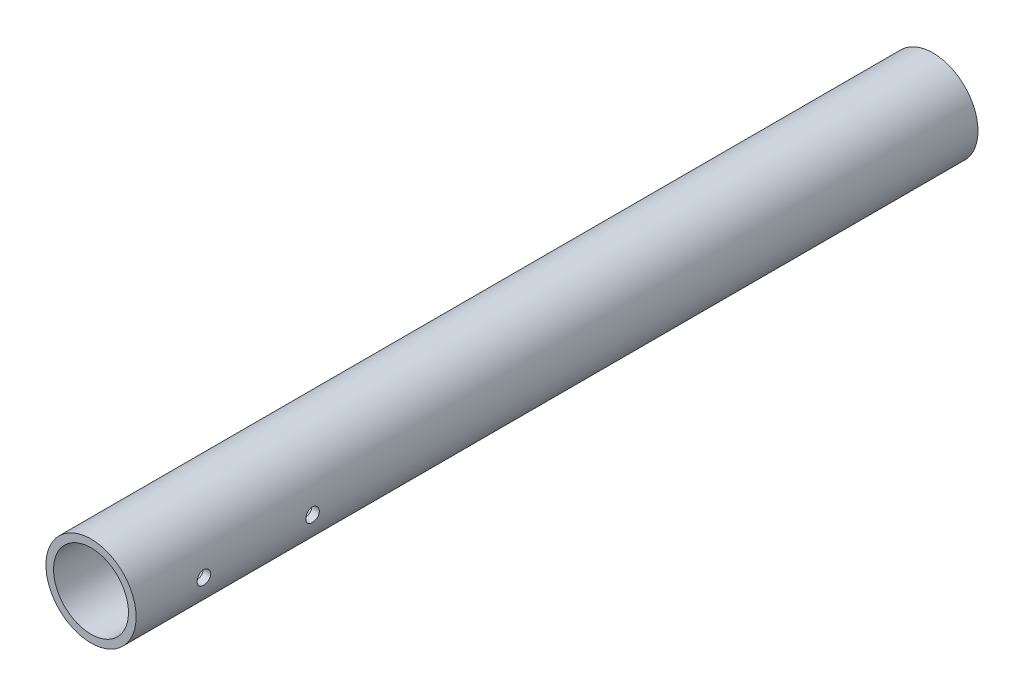
ISO-10303-21;
HEADER;
FILE_DESCRIPTION(('STEP AP214'),'2;1');
FILE_NAME('part.step','',(''),(''),'','','');
FILE_SCHEMA(('AUTOMOTIVE_DESIGN { 1 0 10303 214 1 1 1 1 }'));
ENDSEC;
DATA;
#1=APPLICATION_CONTEXT('core data for automotive mechanical design processes');
#2=APPLICATION_PROTOCOL_DEFINITION('international standard','automotive_design',2000,#1);
#3=PRODUCT_CONTEXT('',#1,'mechanical');
#4=PRODUCT('Part','Part','',(#3));
#5=PRODUCT_RELATED_PRODUCT_CATEGORY('part','',(#4));
#6=PRODUCT_DEFINITION_FORMATION('','',#4);
#7=PRODUCT_DEFINITION_CONTEXT('part definition',#1,'design');
#8=PRODUCT_DEFINITION('design','',#6,#7);
#9=PRODUCT_DEFINITION_SHAPE('','',#8);
#10=(LENGTH_UNIT() NAMED_UNIT(*) SI_UNIT(.MILLI.,.METRE.));
#11=(NAMED_UNIT(*) PLANE_ANGLE_UNIT() SI_UNIT($,.RADIAN.));
#12=(NAMED_UNIT(*) SI_UNIT($,.STERADIAN.) SOLID_ANGLE_UNIT());
#13=UNCERTAINTY_MEASURE_WITH_UNIT(LENGTH_MEASURE(1.E-05),#10,'distance_accuracy_value','');
#14=(GEOMETRIC_REPRESENTATION_CONTEXT(3) GLOBAL_UNCERTAINTY_ASSIGNED_CONTEXT((#13)) GLOBAL_UNIT_ASSIGNED_CONTEXT((#10,
#11,#12)) REPRESENTATION_CONTEXT('',''));
#15=CARTESIAN_POINT('',(0.,0.,0.));
#16=DIRECTION('',(0.,0.,1.));
#17=DIRECTION('',(1.,0.,0.));
#18=AXIS2_PLACEMENT_3D('',#15,#16,#17);
#19=CARTESIAN_POINT('',(0.,0.,0.));
#20=DIRECTION('',(0.,0.,1.));
#21=DIRECTION('',(1.,0.,0.));
#22=AXIS2_PLACEMENT_3D('',#19,#20,#21);
#23=CYLINDRICAL_SURFACE('',#22,17.526);
#24=CARTESIAN_POINT('',(0.,0.,393.7));
#25=DIRECTION('',(0.,0.,1.));
#26=DIRECTION('',(1.,0.,0.));
#27=AXIS2_PLACEMENT_3D('',#24,#25,#26);
#28=CIRCLE('',#27,17.526);
#29=CARTESIAN_POINT('',(17.526,0.,393.7));
#30=VERTEX_POINT('',#29);
#31=EDGE_CURVE('E19',#30,#30,#28,.F.);
#32=ORIENTED_EDGE('',*,*,#31,.F.);
#33=EDGE_LOOP('',(#32));
#34=FACE_BOUND('',#33,.T.);
#35=CARTESIAN_POINT('',(0.,0.,0.));
#36=DIRECTION('',(0.,0.,1.));
#37=DIRECTION('',(1.,0.,0.));
#38=AXIS2_PLACEMENT_3D('',#35,#36,#37);
#39=CIRCLE('',#38,17.526);
#40=CARTESIAN_POINT('',(17.526,0.,0.));
#41=VERTEX_POINT('',#40);
#42=EDGE_CURVE('E79',#41,#41,#39,.F.);
#43=ORIENTED_EDGE('',*,*,#42,.T.);
#44=EDGE_LOOP('',(#43));
#45=FACE_BOUND('',#44,.T.);
#46=CARTESIAN_POINT('',(17.526,0.,314.325));
#47=CARTESIAN_POINT('',(17.5259963175726,-0.176613181051217,314.324991723302));
#48=CARTESIAN_POINT('',(17.5233002826582,-0.353449171258817,314.310200668148));
#49=CARTESIAN_POINT('',(17.5127973362593,-0.702281908474051,314.251423100833));
#50=CARTESIAN_POINT('',(17.5049801575711,-0.874268208471723,314.207377935658));
#51=CARTESIAN_POINT('',(17.48511038614,-1.20810250721723,314.09147464681));
#52=CARTESIAN_POINT('',(17.473063368271,-1.36996352173552,314.019653119444));
#53=CARTESIAN_POINT('',(17.4460554580361,-1.67927316437237,313.850324943954));
#54=CARTESIAN_POINT('',(17.4310956012814,-1.82672688686375,313.752827420172));
#55=CARTESIAN_POINT('',(17.3997238299546,-2.10477719057218,313.533732397024));
#56=CARTESIAN_POINT('',(17.3832987194985,-2.23518750324315,313.411900352404));
#57=CARTESIAN_POINT('',(17.3509459564745,-2.4738411468331,313.14809368207));
#58=CARTESIAN_POINT('',(17.335018364459,-2.58208178835293,313.006116616098));
#59=CARTESIAN_POINT('',(17.3053385875312,-2.77407123838613,312.704766903283));
#60=CARTESIAN_POINT('',(17.2916032051447,-2.85763469507356,312.545274368621));
#61=CARTESIAN_POINT('',(17.2680458993697,-2.99671051245855,312.214226026226));
#62=CARTESIAN_POINT('',(17.2582236283197,-3.05222536525872,312.042671291755));
#63=CARTESIAN_POINT('',(17.2437354897132,-3.13304106760211,311.694333560972));
#64=CARTESIAN_POINT('',(17.2390149777777,-3.15866234519934,311.517627222411));
#65=CARTESIAN_POINT('',(17.2350999262051,-3.17995782709565,311.162365293601));
#66=CARTESIAN_POINT('',(17.2359049331653,-3.17563448853508,310.983809856282));
#67=CARTESIAN_POINT('',(17.2429001543548,-3.13742373793371,310.632230746528));
#68=CARTESIAN_POINT('',(17.2490242048828,-3.10389954139066,310.459166088615));
#69=CARTESIAN_POINT('',(17.2658637551246,-3.00880960849846,310.121157532169));
#70=CARTESIAN_POINT('',(17.276579474651,-2.94724252966902,309.956214022834));
#71=CARTESIAN_POINT('',(17.3014652665683,-2.79745291276667,309.638055892979));
#72=CARTESIAN_POINT('',(17.3156545368537,-2.70908155858381,309.484912899375));
#73=CARTESIAN_POINT('',(17.3458743890737,-2.50830442996264,309.195503775616));
#74=CARTESIAN_POINT('',(17.3619050065012,-2.39589819220297,309.059237970883));
#75=CARTESIAN_POINT('',(17.3942883351767,-2.14829928114741,308.805361728415));
#76=CARTESIAN_POINT('',(17.4106423451863,-2.01279967929529,308.688050627084));
#77=CARTESIAN_POINT('',(17.4416233292778,-1.72381393754225,308.477729015706));
#78=CARTESIAN_POINT('',(17.4562495353167,-1.57031985869497,308.38472929043));
#79=CARTESIAN_POINT('',(17.4821550853627,-1.24935860544027,308.22563859958));
#80=CARTESIAN_POINT('',(17.4934280108005,-1.08186540977745,308.159599150311));
#81=CARTESIAN_POINT('',(17.5112904348231,-0.738132155126105,308.056807400917));
#82=CARTESIAN_POINT('',(17.5178897862262,-0.561911340494518,308.019993467668));
#83=CARTESIAN_POINT('',(17.5231896350432,-0.320322833927916,307.990545032544));
#84=CARTESIAN_POINT('',(17.5242412276541,-0.256410066392405,307.984720466382));
#85=CARTESIAN_POINT('',(17.5256470796399,-0.128341342038203,307.976946444097));
#86=CARTESIAN_POINT('',(17.5260013382808,-0.064185384963603,307.974996992053));
#87=CARTESIAN_POINT('',(17.5259963175725,0.176613181051215,307.975008276698));
#88=CARTESIAN_POINT('',(17.5233002826582,0.353449171258822,307.989799331852));
#89=CARTESIAN_POINT('',(17.5127973362593,0.702281908474058,308.048576899167));
#90=CARTESIAN_POINT('',(17.5049801575711,0.874268208471724,308.092622064342));
#91=CARTESIAN_POINT('',(17.48511038614,1.20810250721723,308.20852535319));
#92=CARTESIAN_POINT('',(17.473063368271,1.36996352173552,308.280346880556));
#93=CARTESIAN_POINT('',(17.4460554580361,1.67927316437237,308.449675056046));
#94=CARTESIAN_POINT('',(17.4310956012814,1.82672688686375,308.547172579828));
#95=CARTESIAN_POINT('',(17.3997238299546,2.10477719057218,308.766267602976));
#96=CARTESIAN_POINT('',(17.3832987194985,2.23518750324315,308.888099647596));
#97=CARTESIAN_POINT('',(17.3509459564745,2.4738411468331,309.15190631793));
#98=CARTESIAN_POINT('',(17.335018364459,2.58208178835293,309.293883383902));
#99=CARTESIAN_POINT('',(17.3053385875312,2.77407123838613,309.595233096717));
#100=CARTESIAN_POINT('',(17.2916032051447,2.85763469507356,309.754725631379));
#101=CARTESIAN_POINT('',(17.2680458993697,2.99671051245855,310.085773973774));
#102=CARTESIAN_POINT('',(17.2582236283197,3.05222536525872,310.257328708245));
#103=CARTESIAN_POINT('',(17.2437354897132,3.13304106760211,310.605666439028));
#104=CARTESIAN_POINT('',(17.2390149777777,3.15866234519934,310.782372777589));
#105=CARTESIAN_POINT('',(17.2350999262051,3.17995782709565,311.137634706399));
#106=CARTESIAN_POINT('',(17.2359049331653,3.17563448853508,311.316190143718));
#107=CARTESIAN_POINT('',(17.2429001543548,3.13742373793371,311.667769253472));
#108=CARTESIAN_POINT('',(17.2490242048828,3.10389954139064,311.840833911385));
#109=CARTESIAN_POINT('',(17.2658637551246,3.00880960849844,312.178842467831));
#110=CARTESIAN_POINT('',(17.276579474651,2.947242529669,312.343785977166));
#111=CARTESIAN_POINT('',(17.3014652665683,2.79745291276668,312.661944107021));
#112=CARTESIAN_POINT('',(17.3156545368537,2.70908155858381,312.815087100625));
#113=CARTESIAN_POINT('',(17.3458743890737,2.50830442996264,313.104496224384));
#114=CARTESIAN_POINT('',(17.3619050065012,2.39589819220297,313.240762029117));
#115=CARTESIAN_POINT('',(17.3942883351767,2.14829928114741,313.494638271585));
#116=CARTESIAN_POINT('',(17.4106423451863,2.01279967929529,313.611949372916));
#117=CARTESIAN_POINT('',(17.4416233292778,1.72381393754225,313.822270984294));
#118=CARTESIAN_POINT('',(17.4562495353167,1.57031985869498,313.91527070957));
#119=CARTESIAN_POINT('',(17.4821550853627,1.24935860544028,314.07436140042));
#120=CARTESIAN_POINT('',(17.4934280108005,1.08186540977744,314.140400849689));
#121=CARTESIAN_POINT('',(17.5112904348231,0.738132155126103,314.243192599083));
#122=CARTESIAN_POINT('',(17.5178897862262,0.561911340494523,314.280006532332));
#123=CARTESIAN_POINT('',(17.5231896350432,0.320322833927918,314.309454967456));
#124=CARTESIAN_POINT('',(17.5242412276541,0.256410066392406,314.315279533618));
#125=CARTESIAN_POINT('',(17.5256470796399,0.1283413420382,314.323053555903));
#126=CARTESIAN_POINT('',(17.5260013382808,0.0641853849635972,314.325003007947));
#127=CARTESIAN_POINT('',(17.526,0.,314.325));
#128=B_SPLINE_CURVE_WITH_KNOTS('',3,(#46,#47,#48,#49,#50,#51,#52,#53,#54,#55,#56,#57,#58,#59,
#60,#61,#62,#63,#64,#65,#66,#67,#68,#69,#70,#71,#72,#73,#74,#75,#76,#77,#78,#79,#80,#81,#82,#83,
#84,#85,#86,#87,#88,#89,#90,#91,#92,#93,#94,#95,#96,#97,#98,#99,#100,#101,#102,#103,#104,#105,
#106,#107,#108,#109,#110,#111,#112,#113,#114,#115,#116,#117,#118,#119,#120,#121,#122,#123,#124,
#125,#126,#127),.UNSPECIFIED.,.T.,.F.,(4,2,2,2,2,2,2,2,2,2,2,2,2,2,2,2,2,2,2,2,2,2,2,2,2,2,2,2,
2,2,2,2,2,2,2,2,2,2,2,2,4),(0.,0.529594384353553,1.06025379692027,1.59021641642847,
2.11999095947089,2.6551421139281,3.19035814908337,3.72949754433927,4.26858902893715,
4.80184732449042,5.33506186343168,5.86173721299796,6.3884377784318,6.91811781642991,
7.44780806601106,7.98518312810164,8.52279617220148,9.06143174460417,9.59892835876537,
9.79139521459187,9.98386227300715,10.5134566573607,11.0441160699274,11.5740786894356,
12.103853232478,12.6390043869353,13.1742204220905,13.7133598173464,14.2524513019443,
14.7857095974976,15.3189241364388,15.8455994860052,16.372300051439,16.9019800894371,
17.4316703390182,17.9690454011088,18.5066584452086,19.0452940176113,19.5827906317725,
19.775257487599,19.9677245460143),.UNSPECIFIED.);
#129=CARTESIAN_POINT('',(17.526,0.,314.325));
#130=VERTEX_POINT('',#129);
#131=EDGE_CURVE('E73',#130,#130,#128,.T.);
#132=ORIENTED_EDGE('',*,*,#131,.T.);
#133=EDGE_LOOP('',(#132));
#134=FACE_BOUND('',#133,.T.);
#135=CARTESIAN_POINT('',(17.526,0.,365.125));
#136=CARTESIAN_POINT('',(17.5259963175726,-0.17661318105122,365.124991723302));
#137=CARTESIAN_POINT('',(17.5233002826582,-0.353449171258823,365.110200668148));
#138=CARTESIAN_POINT('',(17.5127973362593,-0.702281908474057,365.051423100833));
#139=CARTESIAN_POINT('',(17.5049801575711,-0.874268208471725,365.007377935658));
#140=CARTESIAN_POINT('',(17.48511038614,-1.20810250721724,364.89147464681));
#141=CARTESIAN_POINT('',(17.473063368271,-1.36996352173554,364.819653119444));
#142=CARTESIAN_POINT('',(17.4460554580361,-1.67927316437239,364.650324943954));
#143=CARTESIAN_POINT('',(17.4310956012814,-1.82672688686375,364.552827420172));
#144=CARTESIAN_POINT('',(17.3997238299546,-2.10477719057217,364.333732397024));
#145=CARTESIAN_POINT('',(17.3832987194985,-2.23518750324313,364.211900352404));
#146=CARTESIAN_POINT('',(17.3509459564745,-2.47384114683309,363.94809368207));
#147=CARTESIAN_POINT('',(17.335018364459,-2.58208178835292,363.806116616098));
#148=CARTESIAN_POINT('',(17.3053385875312,-2.77407123838613,363.504766903283));
#149=CARTESIAN_POINT('',(17.2916032051447,-2.85763469507356,363.345274368621));
#150=CARTESIAN_POINT('',(17.2680458993697,-2.99671051245856,363.014226026226));
#151=CARTESIAN_POINT('',(17.2582236283197,-3.05222536525872,362.842671291755));
#152=CARTESIAN_POINT('',(17.2437354897132,-3.13304106760211,362.494333560972));
#153=CARTESIAN_POINT('',(17.2390149777777,-3.15866234519934,362.317627222411));
#154=CARTESIAN_POINT('',(17.2350999262051,-3.17995782709565,361.962365293601));
#155=CARTESIAN_POINT('',(17.2359049331653,-3.17563448853508,361.783809856282));
#156=CARTESIAN_POINT('',(17.2429001543548,-3.13742373793372,361.432230746528));
#157=CARTESIAN_POINT('',(17.2490242048828,-3.10389954139067,361.259166088615));
#158=CARTESIAN_POINT('',(17.2658637551246,-3.00880960849848,360.921157532169));
#159=CARTESIAN_POINT('',(17.276579474651,-2.94724252966902,360.756214022834));
#160=CARTESIAN_POINT('',(17.3014652665683,-2.79745291276667,360.438055892979));
#161=CARTESIAN_POINT('',(17.3156545368537,-2.70908155858381,360.284912899375));
#162=CARTESIAN_POINT('',(17.3458743890737,-2.50830442996264,359.995503775616));
#163=CARTESIAN_POINT('',(17.3619050065012,-2.39589819220297,359.859237970883));
#164=CARTESIAN_POINT('',(17.3942883351767,-2.14829928114741,359.605361728415));
#165=CARTESIAN_POINT('',(17.4106423451863,-2.01279967929529,359.488050627084));
#166=CARTESIAN_POINT('',(17.4416233292778,-1.72381393754225,359.277729015706));
#167=CARTESIAN_POINT('',(17.4562495353167,-1.57031985869497,359.18472929043));
#168=CARTESIAN_POINT('',(17.4821550853627,-1.24935860544027,359.02563859958));
#169=CARTESIAN_POINT('',(17.4934280108005,-1.08186540977744,358.959599150311));
#170=CARTESIAN_POINT('',(17.5112904348231,-0.738132155126094,358.856807400917));
#171=CARTESIAN_POINT('',(17.5178897862262,-0.561911340494513,358.819993467668));
#172=CARTESIAN_POINT('',(17.5231896350432,-0.320322833927916,358.790545032544));
#173=CARTESIAN_POINT('',(17.5242412276541,-0.256410066392405,358.784720466382));
#174=CARTESIAN_POINT('',(17.5256470796399,-0.128341342038203,358.776946444097));
#175=CARTESIAN_POINT('',(17.5260013382808,-0.0641853849636031,358.774996992053));
#176=CARTESIAN_POINT('',(17.5259963175725,0.176613181051212,358.775008276698));
#177=CARTESIAN_POINT('',(17.5233002826582,0.353449171258816,358.789799331852));
#178=CARTESIAN_POINT('',(17.5127973362593,0.702281908474051,358.848576899167));
#179=CARTESIAN_POINT('',(17.5049801575711,0.87426820847172,358.892622064342));
#180=CARTESIAN_POINT('',(17.48511038614,1.20810250721724,359.00852535319));
#181=CARTESIAN_POINT('',(17.473063368271,1.36996352173554,359.080346880556));
#182=CARTESIAN_POINT('',(17.4460554580361,1.67927316437239,359.249675056046));
#183=CARTESIAN_POINT('',(17.4310956012814,1.82672688686375,359.347172579828));
#184=CARTESIAN_POINT('',(17.3997238299546,2.10477719057219,359.566267602976));
#185=CARTESIAN_POINT('',(17.3832987194985,2.23518750324317,359.688099647596));
#186=CARTESIAN_POINT('',(17.3509459564745,2.47384114683312,359.95190631793));
#187=CARTESIAN_POINT('',(17.335018364459,2.58208178835294,360.093883383902));
#188=CARTESIAN_POINT('',(17.3053385875312,2.77407123838613,360.395233096718));
#189=CARTESIAN_POINT('',(17.2916032051447,2.85763469507356,360.554725631379));
#190=CARTESIAN_POINT('',(17.2680458993697,2.99671051245856,360.885773973774));
#191=CARTESIAN_POINT('',(17.2582236283197,3.05222536525873,361.057328708245));
#192=CARTESIAN_POINT('',(17.2437354897132,3.13304106760211,361.405666439028));
#193=CARTESIAN_POINT('',(17.2390149777777,3.15866234519934,361.582372777589));
#194=CARTESIAN_POINT('',(17.2350999262051,3.17995782709565,361.937634706399));
#195=CARTESIAN_POINT('',(17.2359049331653,3.17563448853508,362.116190143718));
#196=CARTESIAN_POINT('',(17.2429001543548,3.13742373793371,362.467769253472));
#197=CARTESIAN_POINT('',(17.2490242048829,3.10389954139064,362.640833911385));
#198=CARTESIAN_POINT('',(17.2658637551246,3.00880960849843,362.978842467831));
#199=CARTESIAN_POINT('',(17.276579474651,2.947242529669,363.143785977166));
#200=CARTESIAN_POINT('',(17.3014652665683,2.79745291276667,363.461944107021));
#201=CARTESIAN_POINT('',(17.3156545368537,2.70908155858378,363.615087100625));
#202=CARTESIAN_POINT('',(17.3458743890737,2.50830442996261,363.904496224384));
#203=CARTESIAN_POINT('',(17.3619050065012,2.39589819220297,364.040762029117));
#204=CARTESIAN_POINT('',(17.3942883351767,2.14829928114742,364.294638271585));
#205=CARTESIAN_POINT('',(17.4106423451863,2.0127996792953,364.411949372916));
#206=CARTESIAN_POINT('',(17.4416233292778,1.72381393754226,364.622270984294));
#207=CARTESIAN_POINT('',(17.4562495353167,1.57031985869499,364.71527070957));
#208=CARTESIAN_POINT('',(17.4821550853627,1.24935860544028,364.87436140042));
#209=CARTESIAN_POINT('',(17.4934280108005,1.08186540977744,364.940400849689));
#210=CARTESIAN_POINT('',(17.5112904348231,0.738132155126102,365.043192599083));
#211=CARTESIAN_POINT('',(17.5178897862262,0.561911340494522,365.080006532332));
#212=CARTESIAN_POINT('',(17.5231896350432,0.320322833927917,365.109454967456));
#213=CARTESIAN_POINT('',(17.5242412276541,0.256410066392404,365.115279533618));
#214=CARTESIAN_POINT('',(17.5256470796399,0.128341342038197,365.123053555903));
#215=CARTESIAN_POINT('',(17.5260013382808,0.0641853849635962,365.125003007947));
#216=CARTESIAN_POINT('',(17.526,0.,365.125));
#217=B_SPLINE_CURVE_WITH_KNOTS('',3,(#135,#136,#137,#138,#139,#140,#141,#142,#143,#144,#145,
#146,#147,#148,#149,#150,#151,#152,#153,#154,#155,#156,#157,#158,#159,#160,#161,#162,#163,#164,
#165,#166,#167,#168,#169,#170,#171,#172,#173,#174,#175,#176,#177,#178,#179,#180,#181,#182,#183,
#184,#185,#186,#187,#188,#189,#190,#191,#192,#193,#194,#195,#196,#197,#198,#199,#200,#201,#202,
#203,#204,#205,#206,#207,#208,#209,#210,#211,#212,#213,#214,#215,#216),.UNSPECIFIED.,.T.,.F.,(4,
2,2,2,2,2,2,2,2,2,2,2,2,2,2,2,2,2,2,2,2,2,2,2,2,2,2,2,2,2,2,2,2,2,2,2,2,2,2,2,4),(0.,
0.529594384353562,1.06025379692027,1.59021641642849,2.11999095947089,2.65514211392804,
3.19035814908338,3.72949754433928,4.26858902893715,4.80184732449042,5.33506186343169,
5.86173721299791,6.3884377784318,6.91811781642991,7.44780806601107,7.98518312810165,
8.52279617220148,9.06143174460419,9.59892835876537,9.79139521459188,9.98386227300715,
10.5134566573607,11.0441160699274,11.5740786894356,12.1038532324781,12.6390043869353,
13.1742204220905,13.7133598173464,14.2524513019443,14.7857095974976,15.3189241364388,
15.8455994860052,16.372300051439,16.9019800894371,17.4316703390182,17.9690454011087,
18.5066584452086,19.0452940176113,19.5827906317725,19.775257487599,19.9677245460143),.UNSPECIFIED.);
#218=CARTESIAN_POINT('',(17.526,0.,365.125));
#219=VERTEX_POINT('',#218);
#220=EDGE_CURVE('E78',#219,#219,#217,.T.);
#221=ORIENTED_EDGE('',*,*,#220,.T.);
#222=EDGE_LOOP('',(#221));
#223=FACE_BOUND('',#222,.T.);
#224=ADVANCED_FACE('F15',(#34,#45,#134,#223),#23,.F.);
#225=CARTESIAN_POINT('',(0.,0.,393.7));
#226=DIRECTION('',(0.,0.,1.));
#227=DIRECTION('',(1.,0.,0.));
#228=AXIS2_PLACEMENT_3D('',#225,#226,#227);
#229=PLANE('',#228);
#230=ORIENTED_EDGE('',*,*,#31,.T.);
#231=EDGE_LOOP('',(#230));
#232=FACE_BOUND('',#231,.T.);
#233=CARTESIAN_POINT('',(0.,0.,393.7));
#234=DIRECTION('',(0.,0.,1.));
#235=DIRECTION('',(1.,0.,0.));
#236=AXIS2_PLACEMENT_3D('',#233,#234,#235);
#237=CIRCLE('',#236,21.082);
#238=CARTESIAN_POINT('',(21.082,0.,393.7));
#239=VERTEX_POINT('',#238);
#240=EDGE_CURVE('E54',#239,#239,#237,.F.);
#241=ORIENTED_EDGE('',*,*,#240,.F.);
#242=EDGE_LOOP('',(#241));
#243=FACE_BOUND('',#242,.T.);
#244=ADVANCED_FACE('F66',(#232,#243),#229,.T.);
#245=CARTESIAN_POINT('',(0.,0.,0.));
#246=DIRECTION('',(0.,0.,1.));
#247=DIRECTION('',(1.,0.,0.));
#248=AXIS2_PLACEMENT_3D('',#245,#246,#247);
#249=PLANE('',#248);
#250=ORIENTED_EDGE('',*,*,#42,.F.);
#251=EDGE_LOOP('',(#250));
#252=FACE_BOUND('',#251,.T.);
#253=CARTESIAN_POINT('',(0.,0.,0.));
#254=DIRECTION('',(0.,0.,1.));
#255=DIRECTION('',(1.,0.,0.));
#256=AXIS2_PLACEMENT_3D('',#253,#254,#255);
#257=CIRCLE('',#256,21.082);
#258=CARTESIAN_POINT('',(21.082,0.,0.));
#259=VERTEX_POINT('',#258);
#260=EDGE_CURVE('E28',#259,#259,#257,.T.);
#261=ORIENTED_EDGE('',*,*,#260,.F.);
#262=EDGE_LOOP('',(#261));
#263=FACE_BOUND('',#262,.T.);
#264=ADVANCED_FACE('F61',(#252,#263),#249,.F.);
#265=CARTESIAN_POINT('',(0.,0.,311.15));
#266=DIRECTION('',(1.,0.,0.));
#267=DIRECTION('',(0.,0.,-1.));
#268=AXIS2_PLACEMENT_3D('',#265,#266,#267);
#269=CYLINDRICAL_SURFACE('',#268,3.175);
#270=ORIENTED_EDGE('',*,*,#131,.F.);
#271=EDGE_LOOP('',(#270));
#272=FACE_BOUND('',#271,.T.);
#273=CARTESIAN_POINT('',(21.082,0.,307.975));
#274=CARTESIAN_POINT('',(21.08199697693,-0.17709688232668,307.975008010368));
#275=CARTESIAN_POINT('',(21.0797432371457,-0.354422246181484,307.98987962863));
#276=CARTESIAN_POINT('',(21.0709639947796,-0.704244999090057,308.048992357156));
#277=CARTESIAN_POINT('',(21.0644297330762,-0.876731730624416,308.093293691309));
#278=CARTESIAN_POINT('',(21.0478236267626,-1.21157212719878,308.209916576821));
#279=CARTESIAN_POINT('',(21.0377559284511,-1.37393740737854,308.282205296689));
#280=CARTESIAN_POINT('',(21.0151978427835,-1.68416250683155,308.452677911167));
#281=CARTESIAN_POINT('',(21.0027084021292,-1.83202796044267,308.550851692226));
#282=CARTESIAN_POINT('',(20.9765823177096,-2.11031247055373,308.771151374218));
#283=CARTESIAN_POINT('',(20.9629381187472,-2.24059940402077,308.893443308759));
#284=CARTESIAN_POINT('',(20.9360989041358,-2.47889130977967,309.15815612125));
#285=CARTESIAN_POINT('',(20.9229039374157,-2.58689386136818,309.30057918317));
#286=CARTESIAN_POINT('',(20.8983859370743,-2.77804880392722,309.602379318754));
#287=CARTESIAN_POINT('',(20.8870724896658,-2.86107558124533,309.76183680048));
#288=CARTESIAN_POINT('',(20.8676999734321,-2.99911832257811,310.092631067207));
#289=CARTESIAN_POINT('',(20.8596406975045,-3.05413606920677,310.263967095418));
#290=CARTESIAN_POINT('',(20.8477621063255,-3.13419546665348,310.612286214704));
#291=CARTESIAN_POINT('',(20.8439112642446,-3.15946012056009,310.789216954801));
#292=CARTESIAN_POINT('',(20.8407898414214,-3.17998700169885,311.144845640065));
#293=CARTESIAN_POINT('',(20.8415190033561,-3.17525091449293,311.323543485386));
#294=CARTESIAN_POINT('',(20.8474463650272,-3.13609305999255,311.676055967361));
#295=CARTESIAN_POINT('',(20.8526071214054,-3.10192000349507,311.849898951723));
#296=CARTESIAN_POINT('',(20.8667577563942,-3.00524711666563,312.189356569077));
#297=CARTESIAN_POINT('',(20.8757477764901,-2.94274623966,312.35497089778));
#298=CARTESIAN_POINT('',(20.8965856584325,-2.79093104974242,312.674029881479));
#299=CARTESIAN_POINT('',(20.9084447970673,-2.70151058452643,312.827423259963));
#300=CARTESIAN_POINT('',(20.9336753486097,-2.49847766149159,313.117109939396));
#301=CARTESIAN_POINT('',(20.9470467424824,-2.38486550815859,313.253403455536));
#302=CARTESIAN_POINT('',(20.9739588701191,-2.13533197536228,313.506452795665));
#303=CARTESIAN_POINT('',(20.9874999699534,-1.99920089823695,313.62300187002));
#304=CARTESIAN_POINT('',(21.0131093792406,-1.70912894954015,313.831684321995));
#305=CARTESIAN_POINT('',(21.0251770223332,-1.55518008085437,313.923806674708));
#306=CARTESIAN_POINT('',(21.0464937025039,-1.23362225418932,314.081023003482));
#307=CARTESIAN_POINT('',(21.0557387492241,-1.06599437803164,314.146078761652));
#308=CARTESIAN_POINT('',(21.0703231912675,-0.722245530020103,314.246925293116));
#309=CARTESIAN_POINT('',(21.0756708320201,-0.546143333577574,314.282777868268));
#310=CARTESIAN_POINT('',(21.0798495375515,-0.307328662833126,314.310693304996));
#311=CARTESIAN_POINT('',(21.0806542771979,-0.245995981253082,314.316054107026));
#312=CARTESIAN_POINT('',(21.0817300341182,-0.123118072865918,314.323208848164));
#313=CARTESIAN_POINT('',(21.0820010510576,-0.0615728459255778,314.325002785036));
#314=CARTESIAN_POINT('',(21.08199697693,0.177096882326677,314.324991989632));
#315=CARTESIAN_POINT('',(21.0797432371457,0.354422246181485,314.31012037137));
#316=CARTESIAN_POINT('',(21.0709639947796,0.70424499909006,314.251007642844));
#317=CARTESIAN_POINT('',(21.0644297330762,0.876731730624416,314.206706308691));
#318=CARTESIAN_POINT('',(21.0478236267626,1.21157212719877,314.090083423179));
#319=CARTESIAN_POINT('',(21.0377559284511,1.37393740737852,314.017794703311));
#320=CARTESIAN_POINT('',(21.0151978427835,1.68416250683153,313.847322088833));
#321=CARTESIAN_POINT('',(21.0027084021292,1.83202796044266,313.749148307774));
#322=CARTESIAN_POINT('',(20.9765823177096,2.11031247055373,313.528848625782));
#323=CARTESIAN_POINT('',(20.9629381187472,2.24059940402077,313.406556691241));
#324=CARTESIAN_POINT('',(20.9360989041358,2.47889130977966,313.14184387875));
#325=CARTESIAN_POINT('',(20.9229039374157,2.58689386136818,312.99942081683));
#326=CARTESIAN_POINT('',(20.8983859370743,2.77804880392721,312.697620681246));
#327=CARTESIAN_POINT('',(20.8870724896658,2.86107558124532,312.53816319952));
#328=CARTESIAN_POINT('',(20.8676999734321,2.9991183225781,312.207368932793));
#329=CARTESIAN_POINT('',(20.8596406975045,3.05413606920677,312.036032904582));
#330=CARTESIAN_POINT('',(20.8477621063255,3.13419546665348,311.687713785296));
#331=CARTESIAN_POINT('',(20.8439112642446,3.15946012056009,311.510783045199));
#332=CARTESIAN_POINT('',(20.8407898414214,3.17998700169885,311.155154359935));
#333=CARTESIAN_POINT('',(20.8415190033561,3.17525091449293,310.976456514614));
#334=CARTESIAN_POINT('',(20.8474463650272,3.13609305999255,310.623944032639));
#335=CARTESIAN_POINT('',(20.8526071214054,3.10192000349509,310.450101048277));
#336=CARTESIAN_POINT('',(20.8667577563942,3.00524711666566,310.110643430923));
#337=CARTESIAN_POINT('',(20.8757477764901,2.94274623966001,309.94502910222));
#338=CARTESIAN_POINT('',(20.8965856584325,2.79093104974243,309.625970118521));
#339=CARTESIAN_POINT('',(20.9084447970673,2.70151058452646,309.472576740037));
#340=CARTESIAN_POINT('',(20.9336753486097,2.49847766149166,309.182890060604));
#341=CARTESIAN_POINT('',(20.9470467424824,2.38486550815865,309.046596544464));
#342=CARTESIAN_POINT('',(20.9739588701191,2.13533197536231,308.793547204335));
#343=CARTESIAN_POINT('',(20.9874999699534,1.99920089823697,308.67699812998));
#344=CARTESIAN_POINT('',(21.0131093792406,1.70912894954014,308.468315678005));
#345=CARTESIAN_POINT('',(21.0251770223332,1.55518008085435,308.376193325292));
#346=CARTESIAN_POINT('',(21.0464937025039,1.23362225418928,308.218976996517));
#347=CARTESIAN_POINT('',(21.0557387492241,1.0659943780316,308.153921238348));
#348=CARTESIAN_POINT('',(21.0703231912676,0.722245530020078,308.053074706884));
#349=CARTESIAN_POINT('',(21.0756708320201,0.546143333577566,308.017222131732));
#350=CARTESIAN_POINT('',(21.0798495375515,0.307328662833132,307.989306695004));
#351=CARTESIAN_POINT('',(21.0806542771979,0.245995981253086,307.983945892974));
#352=CARTESIAN_POINT('',(21.0817300341182,0.123118072865918,307.976791151836));
#353=CARTESIAN_POINT('',(21.0820010510576,0.0615728459255751,307.974997214964));
#354=CARTESIAN_POINT('',(21.082,0.,307.975));
#355=B_SPLINE_CURVE_WITH_KNOTS('',3,(#273,#274,#275,#276,#277,#278,#279,#280,#281,#282,#283,
#284,#285,#286,#287,#288,#289,#290,#291,#292,#293,#294,#295,#296,#297,#298,#299,#300,#301,#302,
#303,#304,#305,#306,#307,#308,#309,#310,#311,#312,#313,#314,#315,#316,#317,#318,#319,#320,#321,
#322,#323,#324,#325,#326,#327,#328,#329,#330,#331,#332,#333,#334,#335,#336,#337,#338,#339,#340,
#341,#342,#343,#344,#345,#346,#347,#348,#349,#350,#351,#352,#353,#354),.UNSPECIFIED.,.T.,.F.,(4,
2,2,2,2,2,2,2,2,2,2,2,2,2,2,2,2,2,2,2,2,2,2,2,2,2,2,2,2,2,2,2,2,2,2,2,2,2,2,2,4),(0.,
0.53105577794366,1.06320165039409,1.59472515452001,2.12604129410146,2.66115151001699,
3.19631982320995,3.73413637351611,4.27191869060596,4.80564407774988,5.33933947832746,
5.86856946465915,6.39781900689901,6.9291835073254,7.46054132019028,7.9971588191655,
8.53401810770137,9.07163288703761,9.60810694982833,9.79274371285329,9.9773805916262,
10.5084363695699,11.0405822420203,11.5721057461462,12.1034218857277,12.6385321016432,
13.1737004148361,13.7115169651422,14.2492992822322,14.7830246693761,15.3167200699537,
15.8459500562853,16.3751995985252,16.9065640989515,17.4379219118164,17.9745394107917,
18.5113986993276,19.0490134786638,19.5854875414545,19.7701243044795,19.9547611832524),.UNSPECIFIED.);
#356=CARTESIAN_POINT('',(21.082,0.,307.975));
#357=VERTEX_POINT('',#356);
#358=EDGE_CURVE('E23',#357,#357,#355,.T.);
#359=ORIENTED_EDGE('',*,*,#358,.F.);
#360=EDGE_LOOP('',(#359));
#361=FACE_BOUND('',#360,.T.);
#362=ADVANCED_FACE('F49',(#272,#361),#269,.F.);
#363=CARTESIAN_POINT('',(0.,0.,361.95));
#364=DIRECTION('',(1.,0.,0.));
#365=DIRECTION('',(0.,0.,-1.));
#366=AXIS2_PLACEMENT_3D('',#363,#364,#365);
#367=CYLINDRICAL_SURFACE('',#366,3.175);
#368=ORIENTED_EDGE('',*,*,#220,.F.);
#369=EDGE_LOOP('',(#368));
#370=FACE_BOUND('',#369,.T.);
#371=CARTESIAN_POINT('',(21.082,0.,358.775));
#372=CARTESIAN_POINT('',(21.08199697693,-0.17709688232668,358.775008010368));
#373=CARTESIAN_POINT('',(21.0797432371457,-0.354422246181484,358.78987962863));
#374=CARTESIAN_POINT('',(21.0709639947796,-0.704244999090057,358.848992357156));
#375=CARTESIAN_POINT('',(21.0644297330762,-0.876731730624416,358.893293691309));
#376=CARTESIAN_POINT('',(21.0478236267626,-1.21157212719878,359.009916576821));
#377=CARTESIAN_POINT('',(21.0377559284511,-1.37393740737854,359.082205296689));
#378=CARTESIAN_POINT('',(21.0151978427835,-1.68416250683155,359.252677911167));
#379=CARTESIAN_POINT('',(21.0027084021292,-1.83202796044267,359.350851692226));
#380=CARTESIAN_POINT('',(20.9765823177096,-2.11031247055373,359.571151374218));
#381=CARTESIAN_POINT('',(20.9629381187472,-2.24059940402077,359.693443308759));
#382=CARTESIAN_POINT('',(20.9360989041358,-2.47889130977967,359.95815612125));
#383=CARTESIAN_POINT('',(20.9229039374157,-2.58689386136818,360.10057918317));
#384=CARTESIAN_POINT('',(20.8983859370743,-2.77804880392722,360.402379318754));
#385=CARTESIAN_POINT('',(20.8870724896658,-2.86107558124533,360.56183680048));
#386=CARTESIAN_POINT('',(20.8676999734321,-2.99911832257811,360.892631067207));
#387=CARTESIAN_POINT('',(20.8596406975045,-3.05413606920677,361.063967095418));
#388=CARTESIAN_POINT('',(20.8477621063255,-3.13419546665348,361.412286214704));
#389=CARTESIAN_POINT('',(20.8439112642446,-3.15946012056009,361.589216954801));
#390=CARTESIAN_POINT('',(20.8407898414214,-3.17998700169885,361.944845640065));
#391=CARTESIAN_POINT('',(20.8415190033561,-3.17525091449293,362.123543485386));
#392=CARTESIAN_POINT('',(20.8474463650272,-3.13609305999255,362.476055967361));
#393=CARTESIAN_POINT('',(20.8526071214054,-3.10192000349507,362.649898951723));
#394=CARTESIAN_POINT('',(20.8667577563942,-3.00524711666562,362.989356569077));
#395=CARTESIAN_POINT('',(20.8757477764901,-2.94274623965999,363.15497089778));
#396=CARTESIAN_POINT('',(20.8965856584325,-2.79093104974243,363.474029881479));
#397=CARTESIAN_POINT('',(20.9084447970673,-2.70151058452645,363.627423259963));
#398=CARTESIAN_POINT('',(20.9336753486097,-2.49847766149162,363.917109939396));
#399=CARTESIAN_POINT('',(20.9470467424824,-2.3848655081586,364.053403455536));
#400=CARTESIAN_POINT('',(20.9739588701191,-2.13533197536227,364.306452795665));
#401=CARTESIAN_POINT('',(20.9874999699534,-1.99920089823695,364.42300187002));
#402=CARTESIAN_POINT('',(21.0131093792406,-1.70912894954015,364.631684321995));
#403=CARTESIAN_POINT('',(21.0251770223332,-1.55518008085438,364.723806674708));
#404=CARTESIAN_POINT('',(21.0464937025039,-1.23362225418932,364.881023003482));
#405=CARTESIAN_POINT('',(21.0557387492241,-1.06599437803164,364.946078761652));
#406=CARTESIAN_POINT('',(21.0703231912675,-0.722245530020103,365.046925293116));
#407=CARTESIAN_POINT('',(21.0756708320201,-0.546143333577574,365.082777868268));
#408=CARTESIAN_POINT('',(21.0798495375515,-0.307328662833127,365.110693304996));
#409=CARTESIAN_POINT('',(21.0806542771979,-0.245995981253084,365.116054107026));
#410=CARTESIAN_POINT('',(21.0817300341182,-0.12311807286592,365.123208848164));
#411=CARTESIAN_POINT('',(21.0820010510576,-0.0615728459255789,365.125002785036));
#412=CARTESIAN_POINT('',(21.08199697693,0.177096882326675,365.124991989632));
#413=CARTESIAN_POINT('',(21.0797432371457,0.354422246181479,365.11012037137));
#414=CARTESIAN_POINT('',(21.0709639947796,0.704244999090053,365.051007642844));
#415=CARTESIAN_POINT('',(21.0644297330762,0.876731730624413,365.006706308691));
#416=CARTESIAN_POINT('',(21.0478236267626,1.21157212719877,364.890083423179));
#417=CARTESIAN_POINT('',(21.0377559284511,1.37393740737852,364.817794703311));
#418=CARTESIAN_POINT('',(21.0151978427835,1.68416250683153,364.647322088833));
#419=CARTESIAN_POINT('',(21.0027084021292,1.83202796044265,364.549148307774));
#420=CARTESIAN_POINT('',(20.9765823177096,2.11031247055374,364.328848625782));
#421=CARTESIAN_POINT('',(20.9629381187472,2.24059940402079,364.206556691241));
#422=CARTESIAN_POINT('',(20.9360989041358,2.47889130977969,363.94184387875));
#423=CARTESIAN_POINT('',(20.9229039374157,2.58689386136819,363.79942081683));
#424=CARTESIAN_POINT('',(20.8983859370743,2.77804880392719,363.497620681246));
#425=CARTESIAN_POINT('',(20.8870724896658,2.8610755812453,363.33816319952));
#426=CARTESIAN_POINT('',(20.8676999734321,2.99911832257809,363.007368932793));
#427=CARTESIAN_POINT('',(20.8596406975045,3.05413606920676,362.836032904582));
#428=CARTESIAN_POINT('',(20.8477621063255,3.13419546665347,362.487713785296));
#429=CARTESIAN_POINT('',(20.8439112642446,3.15946012056008,362.310783045199));
#430=CARTESIAN_POINT('',(20.8407898414214,3.17998700169885,361.955154359935));
#431=CARTESIAN_POINT('',(20.8415190033561,3.17525091449293,361.776456514614));
#432=CARTESIAN_POINT('',(20.8474463650272,3.13609305999256,361.423944032639));
#433=CARTESIAN_POINT('',(20.8526071214054,3.1019200034951,361.250101048277));
#434=CARTESIAN_POINT('',(20.8667577563942,3.00524711666567,360.910643430923));
#435=CARTESIAN_POINT('',(20.8757477764901,2.94274623966001,360.74502910222));
#436=CARTESIAN_POINT('',(20.8965856584325,2.79093104974242,360.425970118521));
#437=CARTESIAN_POINT('',(20.9084447970673,2.70151058452645,360.272576740037));
#438=CARTESIAN_POINT('',(20.9336753486097,2.49847766149164,359.982890060604));
#439=CARTESIAN_POINT('',(20.9470467424824,2.38486550815863,359.846596544464));
#440=CARTESIAN_POINT('',(20.9739588701191,2.13533197536232,359.593547204335));
#441=CARTESIAN_POINT('',(20.9874999699534,1.99920089823699,359.47699812998));
#442=CARTESIAN_POINT('',(21.0131093792406,1.70912894954016,359.268315678005));
#443=CARTESIAN_POINT('',(21.0251770223332,1.55518008085436,359.176193325292));
#444=CARTESIAN_POINT('',(21.0464937025039,1.23362225418928,359.018976996517));
#445=CARTESIAN_POINT('',(21.0557387492241,1.06599437803161,358.953921238348));
#446=CARTESIAN_POINT('',(21.0703231912676,0.722245530020089,358.853074706884));
#447=CARTESIAN_POINT('',(21.0756708320201,0.546143333577571,358.817222131732));
#448=CARTESIAN_POINT('',(21.0798495375515,0.307328662833131,358.789306695004));
#449=CARTESIAN_POINT('',(21.0806542771979,0.245995981253086,358.783945892974));
#450=CARTESIAN_POINT('',(21.0817300341182,0.123118072865918,358.776791151836));
#451=CARTESIAN_POINT('',(21.0820010510576,0.0615728459255751,358.774997214964));
#452=CARTESIAN_POINT('',(21.082,0.,358.775));
#453=B_SPLINE_CURVE_WITH_KNOTS('',3,(#371,#372,#373,#374,#375,#376,#377,#378,#379,#380,#381,
#382,#383,#384,#385,#386,#387,#388,#389,#390,#391,#392,#393,#394,#395,#396,#397,#398,#399,#400,
#401,#402,#403,#404,#405,#406,#407,#408,#409,#410,#411,#412,#413,#414,#415,#416,#417,#418,#419,
#420,#421,#422,#423,#424,#425,#426,#427,#428,#429,#430,#431,#432,#433,#434,#435,#436,#437,#438,
#439,#440,#441,#442,#443,#444,#445,#446,#447,#448,#449,#450,#451,#452),.UNSPECIFIED.,.T.,.F.,(4,
2,2,2,2,2,2,2,2,2,2,2,2,2,2,2,2,2,2,2,2,2,2,2,2,2,2,2,2,2,2,2,2,2,2,2,2,2,2,2,4),(0.,
0.53105577794366,1.06320165039409,1.59472515452001,2.12604129410146,2.66115151001699,
3.19631982320995,3.73413637351611,4.27191869060596,4.80564407774993,5.33933947832746,
5.86856946465921,6.39781900689901,6.92918350732539,7.46054132019028,7.99715881916551,
8.53401810770137,9.07163288703761,9.60810694982833,9.79274371285329,9.9773805916262,
10.5084363695699,11.0405822420203,11.5721057461462,12.1034218857277,12.6385321016432,
13.1737004148362,13.7115169651422,14.2492992822322,14.783024669376,15.3167200699537,
15.8459500562852,16.3751995985252,16.9065640989516,17.4379219118164,17.9745394107917,
18.5113986993277,19.0490134786639,19.5854875414545,19.7701243044795,19.9547611832524),.UNSPECIFIED.);
#454=CARTESIAN_POINT('',(21.082,0.,358.775));
#455=VERTEX_POINT('',#454);
#456=EDGE_CURVE('E10',#455,#455,#453,.T.);
#457=ORIENTED_EDGE('',*,*,#456,.F.);
#458=EDGE_LOOP('',(#457));
#459=FACE_BOUND('',#458,.T.);
#460=ADVANCED_FACE('F38',(#370,#459),#367,.F.);
#461=CARTESIAN_POINT('',(0.,0.,0.));
#462=DIRECTION('',(0.,0.,1.));
#463=DIRECTION('',(1.,0.,0.));
#464=AXIS2_PLACEMENT_3D('',#461,#462,#463);
#465=CYLINDRICAL_SURFACE('',#464,21.082);
#466=ORIENTED_EDGE('',*,*,#240,.T.);
#467=EDGE_LOOP('',(#466));
#468=FACE_BOUND('',#467,.T.);
#469=ORIENTED_EDGE('',*,*,#260,.T.);
#470=EDGE_LOOP('',(#469));
#471=FACE_BOUND('',#470,.T.);
#472=ORIENTED_EDGE('',*,*,#358,.T.);
#473=EDGE_LOOP('',(#472));
#474=FACE_BOUND('',#473,.T.);
#475=ORIENTED_EDGE('',*,*,#456,.T.);
#476=EDGE_LOOP('',(#475));
#477=FACE_BOUND('',#476,.T.);
#478=ADVANCED_FACE('F40',(#468,#471,#474,#477),#465,.T.);
#479=CLOSED_SHELL('',(#224,#244,#264,#362,#460,#478));
#480=MANIFOLD_SOLID_BREP('B1',#479);
#481=ADVANCED_BREP_SHAPE_REPRESENTATION('',(#18,#480),#14);
#482=SHAPE_DEFINITION_REPRESENTATION(#9,#481);
ENDSEC;
END-ISO-10303-21;
